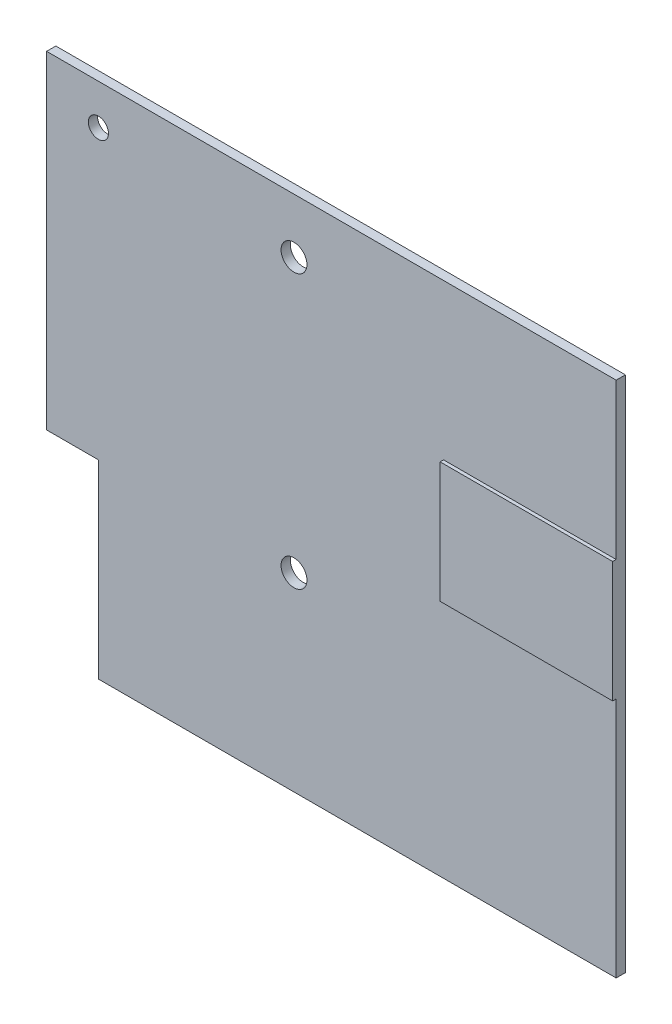
ISO-10303-21;
HEADER;
FILE_DESCRIPTION(('STEP AP214'),'2;1');
FILE_NAME('part.step','',(''),(''),'','','');
FILE_SCHEMA(('AUTOMOTIVE_DESIGN { 1 0 10303 214 1 1 1 1 }'));
ENDSEC;
DATA;
#1=APPLICATION_CONTEXT('core data for automotive mechanical design processes');
#2=APPLICATION_PROTOCOL_DEFINITION('international standard','automotive_design',2000,#1);
#3=PRODUCT_CONTEXT('',#1,'mechanical');
#4=PRODUCT('Part','Part','',(#3));
#5=PRODUCT_RELATED_PRODUCT_CATEGORY('part','',(#4));
#6=PRODUCT_DEFINITION_FORMATION('','',#4);
#7=PRODUCT_DEFINITION_CONTEXT('part definition',#1,'design');
#8=PRODUCT_DEFINITION('design','',#6,#7);
#9=PRODUCT_DEFINITION_SHAPE('','',#8);
#10=(LENGTH_UNIT() NAMED_UNIT(*) SI_UNIT(.MILLI.,.METRE.));
#11=(NAMED_UNIT(*) PLANE_ANGLE_UNIT() SI_UNIT($,.RADIAN.));
#12=(NAMED_UNIT(*) SI_UNIT($,.STERADIAN.) SOLID_ANGLE_UNIT());
#13=UNCERTAINTY_MEASURE_WITH_UNIT(LENGTH_MEASURE(1.E-05),#10,'distance_accuracy_value','');
#14=(GEOMETRIC_REPRESENTATION_CONTEXT(3) GLOBAL_UNCERTAINTY_ASSIGNED_CONTEXT((#13)) GLOBAL_UNIT_ASSIGNED_CONTEXT((#10,
#11,#12)) REPRESENTATION_CONTEXT('',''));
#15=CARTESIAN_POINT('',(0.,0.,0.));
#16=DIRECTION('',(0.,0.,1.));
#17=DIRECTION('',(1.,0.,0.));
#18=AXIS2_PLACEMENT_3D('',#15,#16,#17);
#19=CARTESIAN_POINT('',(0.,0.,0.));
#20=DIRECTION('',(0.,0.,-1.));
#21=DIRECTION('',(-1.,0.,0.));
#22=AXIS2_PLACEMENT_3D('',#19,#20,#21);
#23=PLANE('',#22);
#24=CARTESIAN_POINT('',(9.,83.,0.));
#25=DIRECTION('',(0.,0.,1.));
#26=DIRECTION('',(1.,0.,0.));
#27=AXIS2_PLACEMENT_3D('',#24,#25,#26);
#28=CIRCLE('',#27,1.75);
#29=CARTESIAN_POINT('',(10.75,83.,0.));
#30=VERTEX_POINT('',#29);
#31=EDGE_CURVE('E163',#30,#30,#28,.T.);
#32=ORIENTED_EDGE('',*,*,#31,.F.);
#33=EDGE_LOOP('',(#32));
#34=FACE_BOUND('',#33,.T.);
#35=CARTESIAN_POINT('',(43.,80.5,0.));
#36=DIRECTION('',(0.,0.,1.));
#37=DIRECTION('',(1.,0.,0.));
#38=AXIS2_PLACEMENT_3D('',#35,#36,#37);
#39=CIRCLE('',#38,2.25);
#40=CARTESIAN_POINT('',(45.25,80.5,0.));
#41=VERTEX_POINT('',#40);
#42=EDGE_CURVE('E158',#41,#41,#39,.T.);
#43=ORIENTED_EDGE('',*,*,#42,.F.);
#44=EDGE_LOOP('',(#43));
#45=FACE_BOUND('',#44,.T.);
#46=CARTESIAN_POINT('',(43.,33.,0.));
#47=DIRECTION('',(0.,0.,1.));
#48=DIRECTION('',(1.,0.,0.));
#49=AXIS2_PLACEMENT_3D('',#46,#47,#48);
#50=CIRCLE('',#49,2.25);
#51=CARTESIAN_POINT('',(45.25,33.,0.));
#52=VERTEX_POINT('',#51);
#53=EDGE_CURVE('E135',#52,#52,#50,.T.);
#54=ORIENTED_EDGE('',*,*,#53,.F.);
#55=EDGE_LOOP('',(#54));
#56=FACE_BOUND('',#55,.T.);
#57=DIRECTION('',(1.,0.,0.));
#58=VECTOR('',#57,1.);
#59=CARTESIAN_POINT('',(99.,42.,0.));
#60=LINE('',#59,#58);
#61=CARTESIAN_POINT('',(69.,42.,0.));
#62=VERTEX_POINT('',#61);
#63=CARTESIAN_POINT('',(99.,42.,0.));
#64=VERTEX_POINT('',#63);
#65=EDGE_CURVE('E50',#62,#64,#60,.T.);
#66=ORIENTED_EDGE('',*,*,#65,.F.);
#67=DIRECTION('',(0.,-1.,0.));
#68=VECTOR('',#67,1.);
#69=CARTESIAN_POINT('',(69.,63.,0.));
#70=LINE('',#69,#68);
#71=CARTESIAN_POINT('',(69.,63.,0.));
#72=VERTEX_POINT('',#71);
#73=EDGE_CURVE('E149',#72,#62,#70,.T.);
#74=ORIENTED_EDGE('',*,*,#73,.F.);
#75=DIRECTION('',(-1.,0.,0.));
#76=VECTOR('',#75,1.);
#77=CARTESIAN_POINT('',(99.,63.,0.));
#78=LINE('',#77,#76);
#79=CARTESIAN_POINT('',(99.,62.9999999999999,0.));
#80=VERTEX_POINT('',#79);
#81=EDGE_CURVE('E56',#80,#72,#78,.T.);
#82=ORIENTED_EDGE('',*,*,#81,.F.);
#83=DIRECTION('',(0.,1.,0.));
#84=VECTOR('',#83,1.);
#85=CARTESIAN_POINT('',(99.,0.,0.));
#86=LINE('',#85,#84);
#87=CARTESIAN_POINT('',(99.,90.,0.));
#88=VERTEX_POINT('',#87);
#89=EDGE_CURVE('E134',#80,#88,#86,.T.);
#90=ORIENTED_EDGE('',*,*,#89,.T.);
#91=DIRECTION('',(1.,0.,0.));
#92=VECTOR('',#91,1.);
#93=CARTESIAN_POINT('',(0.,90.,0.));
#94=LINE('',#93,#92);
#95=CARTESIAN_POINT('',(0.,90.,0.));
#96=VERTEX_POINT('',#95);
#97=EDGE_CURVE('E192',#96,#88,#94,.T.);
#98=ORIENTED_EDGE('',*,*,#97,.F.);
#99=DIRECTION('',(0.,1.,0.));
#100=VECTOR('',#99,1.);
#101=CARTESIAN_POINT('',(0.,33.,0.));
#102=LINE('',#101,#100);
#103=CARTESIAN_POINT('',(0.,33.,0.));
#104=VERTEX_POINT('',#103);
#105=EDGE_CURVE('E169',#104,#96,#102,.T.);
#106=ORIENTED_EDGE('',*,*,#105,.F.);
#107=DIRECTION('',(1.,0.,0.));
#108=VECTOR('',#107,1.);
#109=CARTESIAN_POINT('',(0.,33.,0.));
#110=LINE('',#109,#108);
#111=CARTESIAN_POINT('',(9.,33.,0.));
#112=VERTEX_POINT('',#111);
#113=EDGE_CURVE('E176',#104,#112,#110,.T.);
#114=ORIENTED_EDGE('',*,*,#113,.T.);
#115=DIRECTION('',(0.,1.,0.));
#116=VECTOR('',#115,1.);
#117=CARTESIAN_POINT('',(9.,0.,0.));
#118=LINE('',#117,#116);
#119=CARTESIAN_POINT('',(9.,0.,0.));
#120=VERTEX_POINT('',#119);
#121=EDGE_CURVE('E213',#120,#112,#118,.T.);
#122=ORIENTED_EDGE('',*,*,#121,.F.);
#123=DIRECTION('',(1.,0.,0.));
#124=VECTOR('',#123,1.);
#125=CARTESIAN_POINT('',(9.,0.,0.));
#126=LINE('',#125,#124);
#127=CARTESIAN_POINT('',(99.,0.,0.));
#128=VERTEX_POINT('',#127);
#129=EDGE_CURVE('E197',#120,#128,#126,.T.);
#130=ORIENTED_EDGE('',*,*,#129,.T.);
#131=EDGE_CURVE('E202',#128,#64,#86,.T.);
#132=ORIENTED_EDGE('',*,*,#131,.T.);
#133=EDGE_LOOP('',(#66,#74,#82,#90,#98,#106,#114,#122,#130,#132));
#134=FACE_BOUND('',#133,.T.);
#135=ADVANCED_FACE('F33',(#34,#45,#56,#134),#23,.F.);
#136=CARTESIAN_POINT('',(0.,33.,-1.6));
#137=DIRECTION('',(1.,0.,0.));
#138=DIRECTION('',(0.,0.,-1.));
#139=AXIS2_PLACEMENT_3D('',#136,#137,#138);
#140=PLANE('',#139);
#141=ORIENTED_EDGE('',*,*,#105,.T.);
#142=DIRECTION('',(0.,0.,1.));
#143=VECTOR('',#142,1.);
#144=CARTESIAN_POINT('',(0.,90.,-1.6));
#145=LINE('',#144,#143);
#146=CARTESIAN_POINT('',(0.,90.,-1.6));
#147=VERTEX_POINT('',#146);
#148=EDGE_CURVE('E11',#147,#96,#145,.T.);
#149=ORIENTED_EDGE('',*,*,#148,.F.);
#150=DIRECTION('',(0.,1.,0.));
#151=VECTOR('',#150,1.);
#152=CARTESIAN_POINT('',(0.,33.,-1.6));
#153=LINE('',#152,#151);
#154=CARTESIAN_POINT('',(0.,33.,-1.6));
#155=VERTEX_POINT('',#154);
#156=EDGE_CURVE('E172',#155,#147,#153,.T.);
#157=ORIENTED_EDGE('',*,*,#156,.F.);
#158=DIRECTION('',(0.,0.,1.));
#159=VECTOR('',#158,1.);
#160=CARTESIAN_POINT('',(0.,33.,-1.6));
#161=LINE('',#160,#159);
#162=EDGE_CURVE('E189',#155,#104,#161,.T.);
#163=ORIENTED_EDGE('',*,*,#162,.T.);
#164=EDGE_LOOP('',(#141,#149,#157,#163));
#165=FACE_BOUND('',#164,.T.);
#166=ADVANCED_FACE('F35',(#165),#140,.F.);
#167=CARTESIAN_POINT('',(0.,90.,-1.6));
#168=DIRECTION('',(0.,-1.,0.));
#169=DIRECTION('',(0.,0.,-1.));
#170=AXIS2_PLACEMENT_3D('',#167,#168,#169);
#171=PLANE('',#170);
#172=ORIENTED_EDGE('',*,*,#97,.T.);
#173=DIRECTION('',(0.,0.,1.));
#174=VECTOR('',#173,1.);
#175=CARTESIAN_POINT('',(99.,90.,-1.6));
#176=LINE('',#175,#174);
#177=CARTESIAN_POINT('',(99.,90.,-1.6));
#178=VERTEX_POINT('',#177);
#179=EDGE_CURVE('E42',#178,#88,#176,.T.);
#180=ORIENTED_EDGE('',*,*,#179,.F.);
#181=DIRECTION('',(1.,0.,0.));
#182=VECTOR('',#181,1.);
#183=CARTESIAN_POINT('',(0.,90.,-1.6));
#184=LINE('',#183,#182);
#185=EDGE_CURVE('E175',#147,#178,#184,.T.);
#186=ORIENTED_EDGE('',*,*,#185,.F.);
#187=ORIENTED_EDGE('',*,*,#148,.T.);
#188=EDGE_LOOP('',(#172,#180,#186,#187));
#189=FACE_BOUND('',#188,.T.);
#190=ADVANCED_FACE('F245',(#189),#171,.F.);
#191=CARTESIAN_POINT('',(99.,0.,-1.6));
#192=DIRECTION('',(1.,0.,0.));
#193=DIRECTION('',(0.,0.,-1.));
#194=AXIS2_PLACEMENT_3D('',#191,#192,#193);
#195=PLANE('',#194);
#196=ORIENTED_EDGE('',*,*,#131,.F.);
#197=DIRECTION('',(0.,0.,1.));
#198=VECTOR('',#197,1.);
#199=CARTESIAN_POINT('',(99.,0.,-1.6));
#200=LINE('',#199,#198);
#201=CARTESIAN_POINT('',(99.,0.,-1.6));
#202=VERTEX_POINT('',#201);
#203=EDGE_CURVE('E205',#202,#128,#200,.T.);
#204=ORIENTED_EDGE('',*,*,#203,.F.);
#205=DIRECTION('',(0.,1.,0.));
#206=VECTOR('',#205,1.);
#207=CARTESIAN_POINT('',(99.,0.,-1.6));
#208=LINE('',#207,#206);
#209=EDGE_CURVE('E178',#202,#178,#208,.T.);
#210=ORIENTED_EDGE('',*,*,#209,.T.);
#211=ORIENTED_EDGE('',*,*,#179,.T.);
#212=ORIENTED_EDGE('',*,*,#89,.F.);
#213=DIRECTION('',(0.,0.,-1.));
#214=VECTOR('',#213,1.);
#215=CARTESIAN_POINT('',(99.,63.,0.6));
#216=LINE('',#215,#214);
#217=CARTESIAN_POINT('',(99.,63.,0.6));
#218=VERTEX_POINT('',#217);
#219=EDGE_CURVE('E115',#218,#80,#216,.T.);
#220=ORIENTED_EDGE('',*,*,#219,.F.);
#221=DIRECTION('',(0.,1.,0.));
#222=VECTOR('',#221,1.);
#223=CARTESIAN_POINT('',(99.,63.,0.6));
#224=LINE('',#223,#222);
#225=CARTESIAN_POINT('',(99.,42.,0.6));
#226=VERTEX_POINT('',#225);
#227=EDGE_CURVE('E121',#226,#218,#224,.T.);
#228=ORIENTED_EDGE('',*,*,#227,.F.);
#229=DIRECTION('',(0.,0.,-1.));
#230=VECTOR('',#229,1.);
#231=CARTESIAN_POINT('',(99.,42.,0.6));
#232=LINE('',#231,#230);
#233=EDGE_CURVE('E150',#226,#64,#232,.T.);
#234=ORIENTED_EDGE('',*,*,#233,.T.);
#235=EDGE_LOOP('',(#196,#204,#210,#211,#212,#220,#228,#234));
#236=FACE_BOUND('',#235,.T.);
#237=ADVANCED_FACE('F132',(#236),#195,.T.);
#238=CARTESIAN_POINT('',(9.,0.,-1.6));
#239=DIRECTION('',(0.,-1.,0.));
#240=DIRECTION('',(0.,0.,-1.));
#241=AXIS2_PLACEMENT_3D('',#238,#239,#240);
#242=PLANE('',#241);
#243=ORIENTED_EDGE('',*,*,#129,.F.);
#244=DIRECTION('',(0.,0.,1.));
#245=VECTOR('',#244,1.);
#246=CARTESIAN_POINT('',(9.,0.,-1.6));
#247=LINE('',#246,#245);
#248=CARTESIAN_POINT('',(9.,0.,-1.6));
#249=VERTEX_POINT('',#248);
#250=EDGE_CURVE('E207',#249,#120,#247,.T.);
#251=ORIENTED_EDGE('',*,*,#250,.F.);
#252=DIRECTION('',(1.,0.,0.));
#253=VECTOR('',#252,1.);
#254=CARTESIAN_POINT('',(9.,0.,-1.6));
#255=LINE('',#254,#253);
#256=EDGE_CURVE('E181',#249,#202,#255,.T.);
#257=ORIENTED_EDGE('',*,*,#256,.T.);
#258=ORIENTED_EDGE('',*,*,#203,.T.);
#259=EDGE_LOOP('',(#243,#251,#257,#258));
#260=FACE_BOUND('',#259,.T.);
#261=ADVANCED_FACE('F221',(#260),#242,.T.);
#262=CARTESIAN_POINT('',(9.,0.,-1.6));
#263=DIRECTION('',(1.,0.,0.));
#264=DIRECTION('',(0.,0.,-1.));
#265=AXIS2_PLACEMENT_3D('',#262,#263,#264);
#266=PLANE('',#265);
#267=ORIENTED_EDGE('',*,*,#121,.T.);
#268=DIRECTION('',(0.,0.,1.));
#269=VECTOR('',#268,1.);
#270=CARTESIAN_POINT('',(9.,33.,-1.6));
#271=LINE('',#270,#269);
#272=CARTESIAN_POINT('',(9.,33.,-1.6));
#273=VERTEX_POINT('',#272);
#274=EDGE_CURVE('E209',#273,#112,#271,.T.);
#275=ORIENTED_EDGE('',*,*,#274,.F.);
#276=DIRECTION('',(0.,1.,0.));
#277=VECTOR('',#276,1.);
#278=CARTESIAN_POINT('',(9.,0.,-1.6));
#279=LINE('',#278,#277);
#280=EDGE_CURVE('E184',#249,#273,#279,.T.);
#281=ORIENTED_EDGE('',*,*,#280,.F.);
#282=ORIENTED_EDGE('',*,*,#250,.T.);
#283=EDGE_LOOP('',(#267,#275,#281,#282));
#284=FACE_BOUND('',#283,.T.);
#285=ADVANCED_FACE('F256',(#284),#266,.F.);
#286=CARTESIAN_POINT('',(0.,33.,-1.6));
#287=DIRECTION('',(0.,-1.,0.));
#288=DIRECTION('',(0.,0.,-1.));
#289=AXIS2_PLACEMENT_3D('',#286,#287,#288);
#290=PLANE('',#289);
#291=ORIENTED_EDGE('',*,*,#113,.F.);
#292=ORIENTED_EDGE('',*,*,#162,.F.);
#293=DIRECTION('',(1.,0.,0.));
#294=VECTOR('',#293,1.);
#295=CARTESIAN_POINT('',(0.,33.,-1.6));
#296=LINE('',#295,#294);
#297=EDGE_CURVE('E186',#155,#273,#296,.T.);
#298=ORIENTED_EDGE('',*,*,#297,.T.);
#299=ORIENTED_EDGE('',*,*,#274,.T.);
#300=EDGE_LOOP('',(#291,#292,#298,#299));
#301=FACE_BOUND('',#300,.T.);
#302=ADVANCED_FACE('F253',(#301),#290,.T.);
#303=CARTESIAN_POINT('',(0.,0.,-1.6));
#304=DIRECTION('',(0.,0.,-1.));
#305=DIRECTION('',(-1.,0.,0.));
#306=AXIS2_PLACEMENT_3D('',#303,#304,#305);
#307=PLANE('',#306);
#308=CARTESIAN_POINT('',(43.,33.,-1.6));
#309=DIRECTION('',(0.,0.,1.));
#310=DIRECTION('',(1.,0.,0.));
#311=AXIS2_PLACEMENT_3D('',#308,#309,#310);
#312=CIRCLE('',#311,2.25);
#313=CARTESIAN_POINT('',(45.25,33.,-1.6));
#314=VERTEX_POINT('',#313);
#315=EDGE_CURVE('E138',#314,#314,#312,.T.);
#316=ORIENTED_EDGE('',*,*,#315,.T.);
#317=EDGE_LOOP('',(#316));
#318=FACE_BOUND('',#317,.T.);
#319=CARTESIAN_POINT('',(43.,80.5,-1.6));
#320=DIRECTION('',(0.,0.,1.));
#321=DIRECTION('',(1.,0.,0.));
#322=AXIS2_PLACEMENT_3D('',#319,#320,#321);
#323=CIRCLE('',#322,2.25);
#324=CARTESIAN_POINT('',(45.25,80.5,-1.6));
#325=VERTEX_POINT('',#324);
#326=EDGE_CURVE('E160',#325,#325,#323,.T.);
#327=ORIENTED_EDGE('',*,*,#326,.T.);
#328=EDGE_LOOP('',(#327));
#329=FACE_BOUND('',#328,.T.);
#330=CARTESIAN_POINT('',(9.,83.,-1.6));
#331=DIRECTION('',(0.,0.,1.));
#332=DIRECTION('',(1.,0.,0.));
#333=AXIS2_PLACEMENT_3D('',#330,#331,#332);
#334=CIRCLE('',#333,1.75);
#335=CARTESIAN_POINT('',(10.75,83.,-1.6));
#336=VERTEX_POINT('',#335);
#337=EDGE_CURVE('E166',#336,#336,#334,.T.);
#338=ORIENTED_EDGE('',*,*,#337,.T.);
#339=EDGE_LOOP('',(#338));
#340=FACE_BOUND('',#339,.T.);
#341=ORIENTED_EDGE('',*,*,#156,.T.);
#342=ORIENTED_EDGE('',*,*,#185,.T.);
#343=ORIENTED_EDGE('',*,*,#209,.F.);
#344=ORIENTED_EDGE('',*,*,#256,.F.);
#345=ORIENTED_EDGE('',*,*,#280,.T.);
#346=ORIENTED_EDGE('',*,*,#297,.F.);
#347=EDGE_LOOP('',(#341,#342,#343,#344,#345,#346));
#348=FACE_BOUND('',#347,.T.);
#349=ADVANCED_FACE('F251',(#318,#329,#340,#348),#307,.T.);
#350=CARTESIAN_POINT('',(9.,83.,-1.6));
#351=DIRECTION('',(0.,0.,1.));
#352=DIRECTION('',(1.,0.,0.));
#353=AXIS2_PLACEMENT_3D('',#350,#351,#352);
#354=CYLINDRICAL_SURFACE('',#353,1.75);
#355=ORIENTED_EDGE('',*,*,#337,.F.);
#356=EDGE_LOOP('',(#355));
#357=FACE_BOUND('',#356,.T.);
#358=ORIENTED_EDGE('',*,*,#31,.T.);
#359=EDGE_LOOP('',(#358));
#360=FACE_BOUND('',#359,.T.);
#361=ADVANCED_FACE('F275',(#357,#360),#354,.F.);
#362=CARTESIAN_POINT('',(43.,80.5,-1.6));
#363=DIRECTION('',(0.,0.,1.));
#364=DIRECTION('',(1.,0.,0.));
#365=AXIS2_PLACEMENT_3D('',#362,#363,#364);
#366=CYLINDRICAL_SURFACE('',#365,2.25);
#367=ORIENTED_EDGE('',*,*,#326,.F.);
#368=EDGE_LOOP('',(#367));
#369=FACE_BOUND('',#368,.T.);
#370=ORIENTED_EDGE('',*,*,#42,.T.);
#371=EDGE_LOOP('',(#370));
#372=FACE_BOUND('',#371,.T.);
#373=ADVANCED_FACE('F280',(#369,#372),#366,.F.);
#374=CARTESIAN_POINT('',(43.,33.,-1.6));
#375=DIRECTION('',(0.,0.,1.));
#376=DIRECTION('',(1.,0.,0.));
#377=AXIS2_PLACEMENT_3D('',#374,#375,#376);
#378=CYLINDRICAL_SURFACE('',#377,2.25);
#379=ORIENTED_EDGE('',*,*,#315,.F.);
#380=EDGE_LOOP('',(#379));
#381=FACE_BOUND('',#380,.T.);
#382=ORIENTED_EDGE('',*,*,#53,.T.);
#383=EDGE_LOOP('',(#382));
#384=FACE_BOUND('',#383,.T.);
#385=ADVANCED_FACE('F291',(#381,#384),#378,.F.);
#386=CARTESIAN_POINT('',(99.,63.,0.6));
#387=DIRECTION('',(0.,-1.,0.));
#388=DIRECTION('',(0.,0.,-1.));
#389=AXIS2_PLACEMENT_3D('',#386,#387,#388);
#390=PLANE('',#389);
#391=ORIENTED_EDGE('',*,*,#81,.T.);
#392=DIRECTION('',(0.,0.,-1.));
#393=VECTOR('',#392,1.);
#394=CARTESIAN_POINT('',(69.,63.,0.6));
#395=LINE('',#394,#393);
#396=CARTESIAN_POINT('',(69.,63.,0.6));
#397=VERTEX_POINT('',#396);
#398=EDGE_CURVE('E117',#397,#72,#395,.T.);
#399=ORIENTED_EDGE('',*,*,#398,.F.);
#400=DIRECTION('',(-1.,0.,0.));
#401=VECTOR('',#400,1.);
#402=CARTESIAN_POINT('',(99.,63.,0.6));
#403=LINE('',#402,#401);
#404=EDGE_CURVE('E111',#218,#397,#403,.T.);
#405=ORIENTED_EDGE('',*,*,#404,.F.);
#406=ORIENTED_EDGE('',*,*,#219,.T.);
#407=EDGE_LOOP('',(#391,#399,#405,#406));
#408=FACE_BOUND('',#407,.T.);
#409=ADVANCED_FACE('F113',(#408),#390,.F.);
#410=CARTESIAN_POINT('',(69.,63.,0.6));
#411=DIRECTION('',(1.,0.,0.));
#412=DIRECTION('',(0.,0.,-1.));
#413=AXIS2_PLACEMENT_3D('',#410,#411,#412);
#414=PLANE('',#413);
#415=ORIENTED_EDGE('',*,*,#73,.T.);
#416=DIRECTION('',(0.,0.,-1.));
#417=VECTOR('',#416,1.);
#418=CARTESIAN_POINT('',(69.,42.,0.6));
#419=LINE('',#418,#417);
#420=CARTESIAN_POINT('',(69.,42.,0.6));
#421=VERTEX_POINT('',#420);
#422=EDGE_CURVE('E140',#421,#62,#419,.T.);
#423=ORIENTED_EDGE('',*,*,#422,.F.);
#424=DIRECTION('',(0.,-1.,0.));
#425=VECTOR('',#424,1.);
#426=CARTESIAN_POINT('',(69.,63.,0.6));
#427=LINE('',#426,#425);
#428=EDGE_CURVE('E120',#397,#421,#427,.T.);
#429=ORIENTED_EDGE('',*,*,#428,.F.);
#430=ORIENTED_EDGE('',*,*,#398,.T.);
#431=EDGE_LOOP('',(#415,#423,#429,#430));
#432=FACE_BOUND('',#431,.T.);
#433=ADVANCED_FACE('F229',(#432),#414,.F.);
#434=CARTESIAN_POINT('',(99.,42.,0.6));
#435=DIRECTION('',(0.,1.,0.));
#436=DIRECTION('',(-1.,0.,0.));
#437=AXIS2_PLACEMENT_3D('',#434,#435,#436);
#438=PLANE('',#437);
#439=ORIENTED_EDGE('',*,*,#65,.T.);
#440=ORIENTED_EDGE('',*,*,#233,.F.);
#441=DIRECTION('',(1.,0.,0.));
#442=VECTOR('',#441,1.);
#443=CARTESIAN_POINT('',(99.,42.,0.6));
#444=LINE('',#443,#442);
#445=EDGE_CURVE('E126',#421,#226,#444,.T.);
#446=ORIENTED_EDGE('',*,*,#445,.F.);
#447=ORIENTED_EDGE('',*,*,#422,.T.);
#448=EDGE_LOOP('',(#439,#440,#446,#447));
#449=FACE_BOUND('',#448,.T.);
#450=ADVANCED_FACE('F230',(#449),#438,.F.);
#451=CARTESIAN_POINT('',(0.,0.,0.6));
#452=DIRECTION('',(0.,0.,-1.));
#453=DIRECTION('',(-1.,0.,0.));
#454=AXIS2_PLACEMENT_3D('',#451,#452,#453);
#455=PLANE('',#454);
#456=ORIENTED_EDGE('',*,*,#227,.T.);
#457=ORIENTED_EDGE('',*,*,#404,.T.);
#458=ORIENTED_EDGE('',*,*,#428,.T.);
#459=ORIENTED_EDGE('',*,*,#445,.T.);
#460=EDGE_LOOP('',(#456,#457,#458,#459));
#461=FACE_BOUND('',#460,.T.);
#462=ADVANCED_FACE('F124',(#461),#455,.F.);
#463=CLOSED_SHELL('',(#135,#166,#190,#237,#261,#285,#302,#349,#361,#373,#385,#409,#433,#450,#462));
#464=MANIFOLD_SOLID_BREP('B2',#463);
#465=ADVANCED_BREP_SHAPE_REPRESENTATION('',(#18,#464),#14);
#466=SHAPE_DEFINITION_REPRESENTATION(#9,#465);
ENDSEC;
END-ISO-10303-21;
